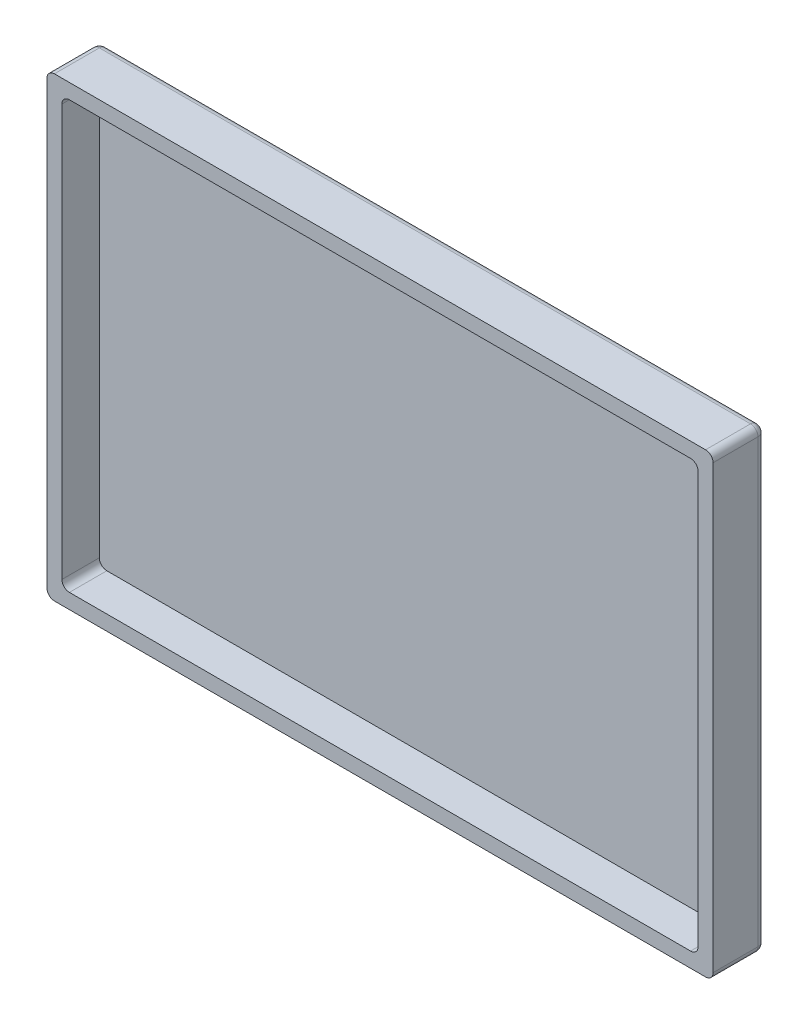
ISO-10303-21;
HEADER;
FILE_DESCRIPTION(('STEP AP214'),'2;1');
FILE_NAME('part.step','',(''),(''),'','','');
FILE_SCHEMA(('AUTOMOTIVE_DESIGN { 1 0 10303 214 1 1 1 1 }'));
ENDSEC;
DATA;
#1=APPLICATION_CONTEXT('core data for automotive mechanical design processes');
#2=APPLICATION_PROTOCOL_DEFINITION('international standard','automotive_design',2000,#1);
#3=PRODUCT_CONTEXT('',#1,'mechanical');
#4=PRODUCT('Part','Part','',(#3));
#5=PRODUCT_RELATED_PRODUCT_CATEGORY('part','',(#4));
#6=PRODUCT_DEFINITION_FORMATION('','',#4);
#7=PRODUCT_DEFINITION_CONTEXT('part definition',#1,'design');
#8=PRODUCT_DEFINITION('design','',#6,#7);
#9=PRODUCT_DEFINITION_SHAPE('','',#8);
#10=(LENGTH_UNIT() NAMED_UNIT(*) SI_UNIT(.MILLI.,.METRE.));
#11=(NAMED_UNIT(*) PLANE_ANGLE_UNIT() SI_UNIT($,.RADIAN.));
#12=(NAMED_UNIT(*) SI_UNIT($,.STERADIAN.) SOLID_ANGLE_UNIT());
#13=UNCERTAINTY_MEASURE_WITH_UNIT(LENGTH_MEASURE(1.E-05),#10,'distance_accuracy_value','');
#14=(GEOMETRIC_REPRESENTATION_CONTEXT(3) GLOBAL_UNCERTAINTY_ASSIGNED_CONTEXT((#13)) GLOBAL_UNIT_ASSIGNED_CONTEXT((#10,
#11,#12)) REPRESENTATION_CONTEXT('',''));
#15=CARTESIAN_POINT('',(0.,0.,0.));
#16=DIRECTION('',(0.,0.,1.));
#17=DIRECTION('',(1.,0.,0.));
#18=AXIS2_PLACEMENT_3D('',#15,#16,#17);
#19=CARTESIAN_POINT('',(0.,0.,5.));
#20=DIRECTION('',(0.,0.,1.));
#21=DIRECTION('',(1.,0.,0.));
#22=AXIS2_PLACEMENT_3D('',#19,#20,#21);
#23=PLANE('',#22);
#24=DIRECTION('',(1.,0.,0.));
#25=VECTOR('',#24,1.);
#26=CARTESIAN_POINT('',(-46.7633401137233,-46.7014218009479,5.));
#27=LINE('',#26,#25);
#28=CARTESIAN_POINT('',(-45.7633401137233,-46.7014218009479,5.));
#29=VERTEX_POINT('',#28);
#30=CARTESIAN_POINT('',(41.2366598862767,-46.7014218009479,5.));
#31=VERTEX_POINT('',#30);
#32=EDGE_CURVE('E367',#29,#31,#27,.T.);
#33=ORIENTED_EDGE('',*,*,#32,.T.);
#34=CARTESIAN_POINT('',(41.2366598862767,-45.7014218009479,5.));
#35=DIRECTION('',(0.,0.,1.));
#36=DIRECTION('',(1.,0.,0.));
#37=AXIS2_PLACEMENT_3D('',#34,#35,#36);
#38=CIRCLE('',#37,1.);
#39=CARTESIAN_POINT('',(42.2366598862767,-45.7014218009479,5.));
#40=VERTEX_POINT('',#39);
#41=EDGE_CURVE('E273',#31,#40,#38,.T.);
#42=ORIENTED_EDGE('',*,*,#41,.T.);
#43=DIRECTION('',(0.,1.,0.));
#44=VECTOR('',#43,1.);
#45=CARTESIAN_POINT('',(42.2366598862767,14.2985781990521,5.));
#46=LINE('',#45,#44);
#47=CARTESIAN_POINT('',(42.2366598862767,13.2985781990521,5.));
#48=VERTEX_POINT('',#47);
#49=EDGE_CURVE('E200',#40,#48,#46,.T.);
#50=ORIENTED_EDGE('',*,*,#49,.T.);
#51=CARTESIAN_POINT('',(41.2366598862767,13.2985781990521,5.));
#52=DIRECTION('',(0.,0.,1.));
#53=DIRECTION('',(1.,0.,0.));
#54=AXIS2_PLACEMENT_3D('',#51,#52,#53);
#55=CIRCLE('',#54,1.);
#56=CARTESIAN_POINT('',(41.2366598862767,14.2985781990521,5.));
#57=VERTEX_POINT('',#56);
#58=EDGE_CURVE('E270',#48,#57,#55,.T.);
#59=ORIENTED_EDGE('',*,*,#58,.T.);
#60=DIRECTION('',(-1.,0.,0.));
#61=VECTOR('',#60,1.);
#62=CARTESIAN_POINT('',(-46.7633401137233,14.2985781990521,5.));
#63=LINE('',#62,#61);
#64=CARTESIAN_POINT('',(-45.7633401137233,14.2985781990521,5.));
#65=VERTEX_POINT('',#64);
#66=EDGE_CURVE('E196',#57,#65,#63,.T.);
#67=ORIENTED_EDGE('',*,*,#66,.T.);
#68=CARTESIAN_POINT('',(-45.7633401137233,13.2985781990521,5.));
#69=DIRECTION('',(0.,0.,1.));
#70=DIRECTION('',(1.,0.,0.));
#71=AXIS2_PLACEMENT_3D('',#68,#69,#70);
#72=CIRCLE('',#71,1.);
#73=CARTESIAN_POINT('',(-46.7633401137233,13.2985781990521,5.));
#74=VERTEX_POINT('',#73);
#75=EDGE_CURVE('E267',#65,#74,#72,.T.);
#76=ORIENTED_EDGE('',*,*,#75,.T.);
#77=DIRECTION('',(0.,-1.,0.));
#78=VECTOR('',#77,1.);
#79=CARTESIAN_POINT('',(-46.7633401137233,14.2985781990521,5.));
#80=LINE('',#79,#78);
#81=CARTESIAN_POINT('',(-46.7633401137233,-45.7014218009479,5.));
#82=VERTEX_POINT('',#81);
#83=EDGE_CURVE('E363',#74,#82,#80,.T.);
#84=ORIENTED_EDGE('',*,*,#83,.T.);
#85=CARTESIAN_POINT('',(-45.7633401137233,-45.7014218009479,5.));
#86=DIRECTION('',(0.,0.,1.));
#87=DIRECTION('',(1.,0.,0.));
#88=AXIS2_PLACEMENT_3D('',#85,#86,#87);
#89=CIRCLE('',#88,1.);
#90=EDGE_CURVE('E254',#82,#29,#89,.T.);
#91=ORIENTED_EDGE('',*,*,#90,.T.);
#92=EDGE_LOOP('',(#33,#42,#50,#59,#67,#76,#84,#91));
#93=FACE_BOUND('',#92,.T.);
#94=DIRECTION('',(1.,0.,0.));
#95=VECTOR('',#94,1.);
#96=CARTESIAN_POINT('',(-44.7633401137233,-44.7014218009479,5.));
#97=LINE('',#96,#95);
#98=CARTESIAN_POINT('',(-43.7633401137233,-44.7014218009479,5.));
#99=VERTEX_POINT('',#98);
#100=CARTESIAN_POINT('',(39.2366598862767,-44.7014218009479,5.));
#101=VERTEX_POINT('',#100);
#102=EDGE_CURVE('E686',#99,#101,#97,.T.);
#103=ORIENTED_EDGE('',*,*,#102,.F.);
#104=CARTESIAN_POINT('',(-43.7633401137233,-43.7014218009479,5.));
#105=DIRECTION('',(0.,0.,1.));
#106=DIRECTION('',(1.,0.,0.));
#107=AXIS2_PLACEMENT_3D('',#104,#105,#106);
#108=CIRCLE('',#107,1.);
#109=CARTESIAN_POINT('',(-44.7633401137233,-43.7014218009478,5.));
#110=VERTEX_POINT('',#109);
#111=EDGE_CURVE('E241',#99,#110,#108,.F.);
#112=ORIENTED_EDGE('',*,*,#111,.T.);
#113=DIRECTION('',(0.,-1.,0.));
#114=VECTOR('',#113,1.);
#115=CARTESIAN_POINT('',(-44.7633401137233,12.2985781990521,5.));
#116=LINE('',#115,#114);
#117=CARTESIAN_POINT('',(-44.7633401137233,11.2985781990521,5.));
#118=VERTEX_POINT('',#117);
#119=EDGE_CURVE('E362',#118,#110,#116,.T.);
#120=ORIENTED_EDGE('',*,*,#119,.F.);
#121=CARTESIAN_POINT('',(-43.7633401137233,11.2985781990521,5.));
#122=DIRECTION('',(0.,0.,1.));
#123=DIRECTION('',(1.,0.,0.));
#124=AXIS2_PLACEMENT_3D('',#121,#122,#123);
#125=CIRCLE('',#124,1.);
#126=CARTESIAN_POINT('',(-43.7633401137233,12.2985781990521,5.));
#127=VERTEX_POINT('',#126);
#128=EDGE_CURVE('E238',#118,#127,#125,.F.);
#129=ORIENTED_EDGE('',*,*,#128,.T.);
#130=DIRECTION('',(-1.,0.,0.));
#131=VECTOR('',#130,1.);
#132=CARTESIAN_POINT('',(-44.7633401137233,12.2985781990521,5.));
#133=LINE('',#132,#131);
#134=CARTESIAN_POINT('',(39.2366598862767,12.2985781990521,5.));
#135=VERTEX_POINT('',#134);
#136=EDGE_CURVE('E357',#135,#127,#133,.T.);
#137=ORIENTED_EDGE('',*,*,#136,.F.);
#138=CARTESIAN_POINT('',(39.2366598862767,11.2985781990521,5.));
#139=DIRECTION('',(0.,0.,1.));
#140=DIRECTION('',(1.,0.,0.));
#141=AXIS2_PLACEMENT_3D('',#138,#139,#140);
#142=CIRCLE('',#141,1.);
#143=CARTESIAN_POINT('',(40.2366598862767,11.2985781990521,5.));
#144=VERTEX_POINT('',#143);
#145=EDGE_CURVE('E206',#135,#144,#142,.F.);
#146=ORIENTED_EDGE('',*,*,#145,.T.);
#147=DIRECTION('',(0.,1.,0.));
#148=VECTOR('',#147,1.);
#149=CARTESIAN_POINT('',(40.2366598862767,12.2985781990521,5.));
#150=LINE('',#149,#148);
#151=CARTESIAN_POINT('',(40.2366598862767,-43.7014218009479,5.));
#152=VERTEX_POINT('',#151);
#153=EDGE_CURVE('E193',#152,#144,#150,.T.);
#154=ORIENTED_EDGE('',*,*,#153,.F.);
#155=CARTESIAN_POINT('',(39.2366598862767,-43.7014218009479,5.));
#156=DIRECTION('',(0.,0.,1.));
#157=DIRECTION('',(1.,0.,0.));
#158=AXIS2_PLACEMENT_3D('',#155,#156,#157);
#159=CIRCLE('',#158,1.);
#160=EDGE_CURVE('E244',#152,#101,#159,.F.);
#161=ORIENTED_EDGE('',*,*,#160,.T.);
#162=EDGE_LOOP('',(#103,#112,#120,#129,#137,#146,#154,#161));
#163=FACE_BOUND('',#162,.T.);
#164=ADVANCED_FACE('F41',(#93,#163),#23,.T.);
#165=CARTESIAN_POINT('',(-46.7633401137233,14.2985781990521,5.));
#166=DIRECTION('',(1.,0.,0.));
#167=DIRECTION('',(0.,1.,0.));
#168=AXIS2_PLACEMENT_3D('',#165,#166,#167);
#169=PLANE('',#168);
#170=DIRECTION('',(0.,0.,-1.));
#171=VECTOR('',#170,1.);
#172=CARTESIAN_POINT('',(-46.7633401137233,13.2985781990521,5.));
#173=LINE('',#172,#171);
#174=CARTESIAN_POINT('',(-46.7633401137233,13.2985781990521,-1.));
#175=VERTEX_POINT('',#174);
#176=EDGE_CURVE('E283',#74,#175,#173,.T.);
#177=ORIENTED_EDGE('',*,*,#176,.T.);
#178=DIRECTION('',(0.,1.,0.));
#179=VECTOR('',#178,1.);
#180=CARTESIAN_POINT('',(-46.7633401137233,-45.7014218009479,-1.));
#181=LINE('',#180,#179);
#182=CARTESIAN_POINT('',(-46.7633401137233,-45.7014218009479,-1.));
#183=VERTEX_POINT('',#182);
#184=EDGE_CURVE('E310',#175,#183,#181,.F.);
#185=ORIENTED_EDGE('',*,*,#184,.T.);
#186=DIRECTION('',(0.,0.,-1.));
#187=VECTOR('',#186,1.);
#188=CARTESIAN_POINT('',(-46.7633401137233,-45.7014218009479,5.));
#189=LINE('',#188,#187);
#190=EDGE_CURVE('E251',#183,#82,#189,.F.);
#191=ORIENTED_EDGE('',*,*,#190,.T.);
#192=ORIENTED_EDGE('',*,*,#83,.F.);
#193=EDGE_LOOP('',(#177,#185,#191,#192));
#194=FACE_BOUND('',#193,.T.);
#195=ADVANCED_FACE('F413',(#194),#169,.F.);
#196=CARTESIAN_POINT('',(-46.7633401137233,-46.7014218009479,5.));
#197=DIRECTION('',(0.,1.,0.));
#198=DIRECTION('',(0.,0.,1.));
#199=AXIS2_PLACEMENT_3D('',#196,#197,#198);
#200=PLANE('',#199);
#201=DIRECTION('',(0.,0.,-1.));
#202=VECTOR('',#201,1.);
#203=CARTESIAN_POINT('',(-45.7633401137233,-46.7014218009479,5.));
#204=LINE('',#203,#202);
#205=CARTESIAN_POINT('',(-45.7633401137233,-46.7014218009479,-1.));
#206=VERTEX_POINT('',#205);
#207=EDGE_CURVE('E247',#29,#206,#204,.T.);
#208=ORIENTED_EDGE('',*,*,#207,.T.);
#209=DIRECTION('',(-1.,0.,0.));
#210=VECTOR('',#209,1.);
#211=CARTESIAN_POINT('',(41.2366598862767,-46.7014218009479,-1.));
#212=LINE('',#211,#210);
#213=CARTESIAN_POINT('',(41.2366598862767,-46.7014218009479,-1.));
#214=VERTEX_POINT('',#213);
#215=EDGE_CURVE('E313',#206,#214,#212,.F.);
#216=ORIENTED_EDGE('',*,*,#215,.T.);
#217=DIRECTION('',(0.,0.,-1.));
#218=VECTOR('',#217,1.);
#219=CARTESIAN_POINT('',(41.2366598862767,-46.7014218009479,5.));
#220=LINE('',#219,#218);
#221=EDGE_CURVE('E264',#214,#31,#220,.F.);
#222=ORIENTED_EDGE('',*,*,#221,.T.);
#223=ORIENTED_EDGE('',*,*,#32,.F.);
#224=EDGE_LOOP('',(#208,#216,#222,#223));
#225=FACE_BOUND('',#224,.T.);
#226=ADVANCED_FACE('F421',(#225),#200,.F.);
#227=CARTESIAN_POINT('',(42.2366598862767,14.2985781990521,5.));
#228=DIRECTION('',(-1.,0.,0.));
#229=DIRECTION('',(0.,-1.,0.));
#230=AXIS2_PLACEMENT_3D('',#227,#228,#229);
#231=PLANE('',#230);
#232=DIRECTION('',(0.,0.,-1.));
#233=VECTOR('',#232,1.);
#234=CARTESIAN_POINT('',(42.2366598862767,-45.7014218009479,5.));
#235=LINE('',#234,#233);
#236=CARTESIAN_POINT('',(42.2366598862767,-45.7014218009479,-1.));
#237=VERTEX_POINT('',#236);
#238=EDGE_CURVE('E260',#40,#237,#235,.T.);
#239=ORIENTED_EDGE('',*,*,#238,.T.);
#240=DIRECTION('',(0.,-1.,0.));
#241=VECTOR('',#240,1.);
#242=CARTESIAN_POINT('',(42.2366598862767,13.2985781990521,-1.));
#243=LINE('',#242,#241);
#244=CARTESIAN_POINT('',(42.2366598862767,13.2985781990521,-1.));
#245=VERTEX_POINT('',#244);
#246=EDGE_CURVE('E51',#237,#245,#243,.F.);
#247=ORIENTED_EDGE('',*,*,#246,.T.);
#248=DIRECTION('',(0.,0.,-1.));
#249=VECTOR('',#248,1.);
#250=CARTESIAN_POINT('',(42.2366598862767,13.2985781990521,5.));
#251=LINE('',#250,#249);
#252=EDGE_CURVE('E257',#245,#48,#251,.F.);
#253=ORIENTED_EDGE('',*,*,#252,.T.);
#254=ORIENTED_EDGE('',*,*,#49,.F.);
#255=EDGE_LOOP('',(#239,#247,#253,#254));
#256=FACE_BOUND('',#255,.T.);
#257=ADVANCED_FACE('F447',(#256),#231,.F.);
#258=CARTESIAN_POINT('',(-46.7633401137233,14.2985781990521,5.));
#259=DIRECTION('',(0.,-1.,0.));
#260=DIRECTION('',(0.,0.,-1.));
#261=AXIS2_PLACEMENT_3D('',#258,#259,#260);
#262=PLANE('',#261);
#263=DIRECTION('',(0.,0.,-1.));
#264=VECTOR('',#263,1.);
#265=CARTESIAN_POINT('',(41.2366598862767,14.2985781990521,5.));
#266=LINE('',#265,#264);
#267=CARTESIAN_POINT('',(41.2366598862767,14.2985781990521,-1.));
#268=VERTEX_POINT('',#267);
#269=EDGE_CURVE('E279',#57,#268,#266,.T.);
#270=ORIENTED_EDGE('',*,*,#269,.T.);
#271=DIRECTION('',(1.,0.,0.));
#272=VECTOR('',#271,1.);
#273=CARTESIAN_POINT('',(-45.7633401137233,14.2985781990521,-1.));
#274=LINE('',#273,#272);
#275=CARTESIAN_POINT('',(-45.7633401137233,14.2985781990521,-1.));
#276=VERTEX_POINT('',#275);
#277=EDGE_CURVE('E11',#268,#276,#274,.F.);
#278=ORIENTED_EDGE('',*,*,#277,.T.);
#279=DIRECTION('',(0.,0.,-1.));
#280=VECTOR('',#279,1.);
#281=CARTESIAN_POINT('',(-45.7633401137233,14.2985781990521,5.));
#282=LINE('',#281,#280);
#283=EDGE_CURVE('E276',#276,#65,#282,.F.);
#284=ORIENTED_EDGE('',*,*,#283,.T.);
#285=ORIENTED_EDGE('',*,*,#66,.F.);
#286=EDGE_LOOP('',(#270,#278,#284,#285));
#287=FACE_BOUND('',#286,.T.);
#288=ADVANCED_FACE('F388',(#287),#262,.F.);
#289=CARTESIAN_POINT('',(-44.7633401137233,12.2985781990521,5.));
#290=DIRECTION('',(1.,0.,0.));
#291=DIRECTION('',(0.,0.,-1.));
#292=AXIS2_PLACEMENT_3D('',#289,#290,#291);
#293=PLANE('',#292);
#294=DIRECTION('',(0.,-1.,0.));
#295=VECTOR('',#294,1.);
#296=CARTESIAN_POINT('',(-44.7633401137233,12.2985781990521,0.));
#297=LINE('',#296,#295);
#298=CARTESIAN_POINT('',(-44.7633401137233,11.2985781990521,0.));
#299=VERTEX_POINT('',#298);
#300=CARTESIAN_POINT('',(-44.7633401137233,-43.7014218009478,0.));
#301=VERTEX_POINT('',#300);
#302=EDGE_CURVE('E347',#299,#301,#297,.T.);
#303=ORIENTED_EDGE('',*,*,#302,.F.);
#304=DIRECTION('',(0.,0.,-1.));
#305=VECTOR('',#304,1.);
#306=CARTESIAN_POINT('',(-44.7633401137233,11.2985781990521,5.));
#307=LINE('',#306,#305);
#308=EDGE_CURVE('E225',#299,#118,#307,.F.);
#309=ORIENTED_EDGE('',*,*,#308,.T.);
#310=ORIENTED_EDGE('',*,*,#119,.T.);
#311=DIRECTION('',(0.,0.,-1.));
#312=VECTOR('',#311,1.);
#313=CARTESIAN_POINT('',(-44.7633401137233,-43.7014218009479,0.));
#314=LINE('',#313,#312);
#315=EDGE_CURVE('E221',#110,#301,#314,.T.);
#316=ORIENTED_EDGE('',*,*,#315,.T.);
#317=EDGE_LOOP('',(#303,#309,#310,#316));
#318=FACE_BOUND('',#317,.T.);
#319=ADVANCED_FACE('F443',(#318),#293,.T.);
#320=CARTESIAN_POINT('',(-44.7633401137233,-44.7014218009479,5.));
#321=DIRECTION('',(0.,1.,0.));
#322=DIRECTION('',(-1.,0.,0.));
#323=AXIS2_PLACEMENT_3D('',#320,#321,#322);
#324=PLANE('',#323);
#325=DIRECTION('',(1.,0.,0.));
#326=VECTOR('',#325,1.);
#327=CARTESIAN_POINT('',(-44.7633401137233,-44.7014218009479,0.));
#328=LINE('',#327,#326);
#329=CARTESIAN_POINT('',(-43.7633401137233,-44.7014218009479,0.));
#330=VERTEX_POINT('',#329);
#331=CARTESIAN_POINT('',(39.2366598862767,-44.7014218009479,0.));
#332=VERTEX_POINT('',#331);
#333=EDGE_CURVE('E180',#330,#332,#328,.T.);
#334=ORIENTED_EDGE('',*,*,#333,.F.);
#335=DIRECTION('',(0.,0.,-1.));
#336=VECTOR('',#335,1.);
#337=CARTESIAN_POINT('',(-43.7633401137233,-44.7014218009479,5.));
#338=LINE('',#337,#336);
#339=EDGE_CURVE('E232',#330,#99,#338,.F.);
#340=ORIENTED_EDGE('',*,*,#339,.T.);
#341=ORIENTED_EDGE('',*,*,#102,.T.);
#342=DIRECTION('',(0.,0.,-1.));
#343=VECTOR('',#342,1.);
#344=CARTESIAN_POINT('',(39.2366598862767,-44.7014218009479,0.));
#345=LINE('',#344,#343);
#346=EDGE_CURVE('E228',#101,#332,#345,.T.);
#347=ORIENTED_EDGE('',*,*,#346,.T.);
#348=EDGE_LOOP('',(#334,#340,#341,#347));
#349=FACE_BOUND('',#348,.T.);
#350=ADVANCED_FACE('F640',(#349),#324,.T.);
#351=CARTESIAN_POINT('',(40.2366598862767,12.2985781990521,5.));
#352=DIRECTION('',(-1.,0.,0.));
#353=DIRECTION('',(0.,-1.,0.));
#354=AXIS2_PLACEMENT_3D('',#351,#352,#353);
#355=PLANE('',#354);
#356=DIRECTION('',(0.,1.,0.));
#357=VECTOR('',#356,1.);
#358=CARTESIAN_POINT('',(40.2366598862767,12.2985781990521,0.));
#359=LINE('',#358,#357);
#360=CARTESIAN_POINT('',(40.2366598862767,-43.7014218009479,0.));
#361=VERTEX_POINT('',#360);
#362=CARTESIAN_POINT('',(40.2366598862767,11.2985781990521,0.));
#363=VERTEX_POINT('',#362);
#364=EDGE_CURVE('E167',#361,#363,#359,.T.);
#365=ORIENTED_EDGE('',*,*,#364,.F.);
#366=DIRECTION('',(0.,0.,-1.));
#367=VECTOR('',#366,1.);
#368=CARTESIAN_POINT('',(40.2366598862767,-43.7014218009479,5.));
#369=LINE('',#368,#367);
#370=EDGE_CURVE('E235',#361,#152,#369,.F.);
#371=ORIENTED_EDGE('',*,*,#370,.T.);
#372=ORIENTED_EDGE('',*,*,#153,.T.);
#373=DIRECTION('',(0.,0.,-1.));
#374=VECTOR('',#373,1.);
#375=CARTESIAN_POINT('',(40.2366598862767,11.2985781990521,0.));
#376=LINE('',#375,#374);
#377=EDGE_CURVE('E187',#144,#363,#376,.T.);
#378=ORIENTED_EDGE('',*,*,#377,.T.);
#379=EDGE_LOOP('',(#365,#371,#372,#378));
#380=FACE_BOUND('',#379,.T.);
#381=ADVANCED_FACE('F191',(#380),#355,.T.);
#382=CARTESIAN_POINT('',(-44.7633401137233,12.2985781990521,5.));
#383=DIRECTION('',(0.,-1.,0.));
#384=DIRECTION('',(0.,0.,-1.));
#385=AXIS2_PLACEMENT_3D('',#382,#383,#384);
#386=PLANE('',#385);
#387=ORIENTED_EDGE('',*,*,#136,.T.);
#388=DIRECTION('',(0.,0.,-1.));
#389=VECTOR('',#388,1.);
#390=CARTESIAN_POINT('',(-43.7633401137233,12.2985781990521,0.));
#391=LINE('',#390,#389);
#392=CARTESIAN_POINT('',(-43.7633401137233,12.2985781990521,0.));
#393=VERTEX_POINT('',#392);
#394=EDGE_CURVE('E209',#127,#393,#391,.T.);
#395=ORIENTED_EDGE('',*,*,#394,.T.);
#396=DIRECTION('',(-1.,0.,0.));
#397=VECTOR('',#396,1.);
#398=CARTESIAN_POINT('',(-44.7633401137233,12.2985781990521,0.));
#399=LINE('',#398,#397);
#400=CARTESIAN_POINT('',(39.2366598862767,12.2985781990521,0.));
#401=VERTEX_POINT('',#400);
#402=EDGE_CURVE('E179',#401,#393,#399,.T.);
#403=ORIENTED_EDGE('',*,*,#402,.F.);
#404=DIRECTION('',(0.,0.,-1.));
#405=VECTOR('',#404,1.);
#406=CARTESIAN_POINT('',(39.2366598862767,12.2985781990521,5.));
#407=LINE('',#406,#405);
#408=EDGE_CURVE('E188',#401,#135,#407,.F.);
#409=ORIENTED_EDGE('',*,*,#408,.T.);
#410=EDGE_LOOP('',(#387,#395,#403,#409));
#411=FACE_BOUND('',#410,.T.);
#412=ADVANCED_FACE('F591',(#411),#386,.T.);
#413=CARTESIAN_POINT('',(0.,0.,0.));
#414=DIRECTION('',(0.,0.,-1.));
#415=DIRECTION('',(-1.,0.,0.));
#416=AXIS2_PLACEMENT_3D('',#413,#414,#415);
#417=PLANE('',#416);
#418=ORIENTED_EDGE('',*,*,#402,.T.);
#419=CARTESIAN_POINT('',(-43.7633401137233,11.2985781990521,0.));
#420=DIRECTION('',(0.,0.,-1.));
#421=DIRECTION('',(-1.,0.,0.));
#422=AXIS2_PLACEMENT_3D('',#419,#420,#421);
#423=CIRCLE('',#422,1.);
#424=EDGE_CURVE('E218',#393,#299,#423,.F.);
#425=ORIENTED_EDGE('',*,*,#424,.T.);
#426=ORIENTED_EDGE('',*,*,#302,.T.);
#427=CARTESIAN_POINT('',(-43.7633401137233,-43.7014218009479,0.));
#428=DIRECTION('',(0.,0.,-1.));
#429=DIRECTION('',(-1.,0.,0.));
#430=AXIS2_PLACEMENT_3D('',#427,#428,#429);
#431=CIRCLE('',#430,1.);
#432=EDGE_CURVE('E215',#301,#330,#431,.F.);
#433=ORIENTED_EDGE('',*,*,#432,.T.);
#434=ORIENTED_EDGE('',*,*,#333,.T.);
#435=CARTESIAN_POINT('',(39.2366598862767,-43.7014218009479,0.));
#436=DIRECTION('',(0.,0.,-1.));
#437=DIRECTION('',(-1.,0.,0.));
#438=AXIS2_PLACEMENT_3D('',#435,#436,#437);
#439=CIRCLE('',#438,1.);
#440=EDGE_CURVE('E174',#332,#361,#439,.F.);
#441=ORIENTED_EDGE('',*,*,#440,.T.);
#442=ORIENTED_EDGE('',*,*,#364,.T.);
#443=CARTESIAN_POINT('',(39.2366598862767,11.2985781990521,0.));
#444=DIRECTION('',(0.,0.,-1.));
#445=DIRECTION('',(-1.,0.,0.));
#446=AXIS2_PLACEMENT_3D('',#443,#444,#445);
#447=CIRCLE('',#446,1.);
#448=EDGE_CURVE('E171',#363,#401,#447,.F.);
#449=ORIENTED_EDGE('',*,*,#448,.T.);
#450=EDGE_LOOP('',(#418,#425,#426,#433,#434,#441,#442,#449));
#451=FACE_BOUND('',#450,.T.);
#452=ADVANCED_FACE('F170',(#451),#417,.F.);
#453=CARTESIAN_POINT('',(0.,0.,-2.));
#454=DIRECTION('',(0.,0.,-1.));
#455=DIRECTION('',(-1.,0.,0.));
#456=AXIS2_PLACEMENT_3D('',#453,#454,#455);
#457=PLANE('',#456);
#458=DIRECTION('',(-1.,0.,0.));
#459=VECTOR('',#458,1.);
#460=CARTESIAN_POINT('',(-45.7633401137233,-45.7014218009479,-2.));
#461=LINE('',#460,#459);
#462=CARTESIAN_POINT('',(41.2366598862767,-45.7014218009479,-2.));
#463=VERTEX_POINT('',#462);
#464=CARTESIAN_POINT('',(-45.7633401137233,-45.7014218009479,-2.));
#465=VERTEX_POINT('',#464);
#466=EDGE_CURVE('E59',#463,#465,#461,.T.);
#467=ORIENTED_EDGE('',*,*,#466,.T.);
#468=DIRECTION('',(0.,1.,0.));
#469=VECTOR('',#468,1.);
#470=CARTESIAN_POINT('',(-45.7633401137233,13.2985781990521,-2.));
#471=LINE('',#470,#469);
#472=CARTESIAN_POINT('',(-45.7633401137233,13.2985781990521,-2.));
#473=VERTEX_POINT('',#472);
#474=EDGE_CURVE('E307',#465,#473,#471,.T.);
#475=ORIENTED_EDGE('',*,*,#474,.T.);
#476=DIRECTION('',(1.,0.,0.));
#477=VECTOR('',#476,1.);
#478=CARTESIAN_POINT('',(41.2366598862767,13.2985781990521,-2.));
#479=LINE('',#478,#477);
#480=CARTESIAN_POINT('',(41.2366598862767,13.2985781990521,-2.));
#481=VERTEX_POINT('',#480);
#482=EDGE_CURVE('E300',#473,#481,#479,.T.);
#483=ORIENTED_EDGE('',*,*,#482,.T.);
#484=DIRECTION('',(0.,-1.,0.));
#485=VECTOR('',#484,1.);
#486=CARTESIAN_POINT('',(41.2366598862767,-45.7014218009479,-2.));
#487=LINE('',#486,#485);
#488=EDGE_CURVE('E64',#481,#463,#487,.T.);
#489=ORIENTED_EDGE('',*,*,#488,.T.);
#490=EDGE_LOOP('',(#467,#475,#483,#489));
#491=FACE_BOUND('',#490,.T.);
#492=ADVANCED_FACE('F455',(#491),#457,.T.);
#493=CARTESIAN_POINT('',(39.2366598862767,11.2985781990521,5.));
#494=DIRECTION('',(0.,0.,1.));
#495=DIRECTION('',(1.,0.,0.));
#496=AXIS2_PLACEMENT_3D('',#493,#494,#495);
#497=CYLINDRICAL_SURFACE('',#496,1.);
#498=ORIENTED_EDGE('',*,*,#145,.F.);
#499=ORIENTED_EDGE('',*,*,#408,.F.);
#500=ORIENTED_EDGE('',*,*,#448,.F.);
#501=ORIENTED_EDGE('',*,*,#377,.F.);
#502=EDGE_LOOP('',(#498,#499,#500,#501));
#503=FACE_BOUND('',#502,.T.);
#504=ADVANCED_FACE('F186',(#503),#497,.F.);
#505=CARTESIAN_POINT('',(-43.7633401137233,11.2985781990521,5.));
#506=DIRECTION('',(0.,0.,1.));
#507=DIRECTION('',(1.,0.,0.));
#508=AXIS2_PLACEMENT_3D('',#505,#506,#507);
#509=CYLINDRICAL_SURFACE('',#508,1.);
#510=ORIENTED_EDGE('',*,*,#128,.F.);
#511=ORIENTED_EDGE('',*,*,#308,.F.);
#512=ORIENTED_EDGE('',*,*,#424,.F.);
#513=ORIENTED_EDGE('',*,*,#394,.F.);
#514=EDGE_LOOP('',(#510,#511,#512,#513));
#515=FACE_BOUND('',#514,.T.);
#516=ADVANCED_FACE('F454',(#515),#509,.F.);
#517=CARTESIAN_POINT('',(-43.7633401137233,-43.7014218009479,5.));
#518=DIRECTION('',(0.,0.,1.));
#519=DIRECTION('',(1.,0.,0.));
#520=AXIS2_PLACEMENT_3D('',#517,#518,#519);
#521=CYLINDRICAL_SURFACE('',#520,1.);
#522=ORIENTED_EDGE('',*,*,#111,.F.);
#523=ORIENTED_EDGE('',*,*,#339,.F.);
#524=ORIENTED_EDGE('',*,*,#432,.F.);
#525=ORIENTED_EDGE('',*,*,#315,.F.);
#526=EDGE_LOOP('',(#522,#523,#524,#525));
#527=FACE_BOUND('',#526,.T.);
#528=ADVANCED_FACE('F458',(#527),#521,.F.);
#529=CARTESIAN_POINT('',(39.2366598862767,-43.7014218009479,5.));
#530=DIRECTION('',(0.,0.,1.));
#531=DIRECTION('',(1.,0.,0.));
#532=AXIS2_PLACEMENT_3D('',#529,#530,#531);
#533=CYLINDRICAL_SURFACE('',#532,1.);
#534=ORIENTED_EDGE('',*,*,#160,.F.);
#535=ORIENTED_EDGE('',*,*,#370,.F.);
#536=ORIENTED_EDGE('',*,*,#440,.F.);
#537=ORIENTED_EDGE('',*,*,#346,.F.);
#538=EDGE_LOOP('',(#534,#535,#536,#537));
#539=FACE_BOUND('',#538,.T.);
#540=ADVANCED_FACE('F462',(#539),#533,.F.);
#541=CARTESIAN_POINT('',(-45.7633401137233,-45.7014218009479,5.));
#542=DIRECTION('',(0.,0.,-1.));
#543=DIRECTION('',(-1.,0.,0.));
#544=AXIS2_PLACEMENT_3D('',#541,#542,#543);
#545=CYLINDRICAL_SURFACE('',#544,1.);
#546=ORIENTED_EDGE('',*,*,#190,.F.);
#547=CARTESIAN_POINT('',(-45.7633401137233,-45.7014218009479,-1.));
#548=DIRECTION('',(0.,0.,-1.));
#549=DIRECTION('',(-1.,0.,0.));
#550=AXIS2_PLACEMENT_3D('',#547,#548,#549);
#551=CIRCLE('',#550,1.);
#552=EDGE_CURVE('E291',#183,#206,#551,.F.);
#553=ORIENTED_EDGE('',*,*,#552,.T.);
#554=ORIENTED_EDGE('',*,*,#207,.F.);
#555=ORIENTED_EDGE('',*,*,#90,.F.);
#556=EDGE_LOOP('',(#546,#553,#554,#555));
#557=FACE_BOUND('',#556,.T.);
#558=ADVANCED_FACE('F418',(#557),#545,.T.);
#559=CARTESIAN_POINT('',(41.2366598862767,-45.7014218009479,5.));
#560=DIRECTION('',(0.,0.,-1.));
#561=DIRECTION('',(-1.,0.,0.));
#562=AXIS2_PLACEMENT_3D('',#559,#560,#561);
#563=CYLINDRICAL_SURFACE('',#562,1.);
#564=ORIENTED_EDGE('',*,*,#221,.F.);
#565=CARTESIAN_POINT('',(41.2366598862767,-45.7014218009479,-1.));
#566=DIRECTION('',(0.,0.,-1.));
#567=DIRECTION('',(-1.,0.,0.));
#568=AXIS2_PLACEMENT_3D('',#565,#566,#567);
#569=CIRCLE('',#568,1.);
#570=EDGE_CURVE('E294',#214,#237,#569,.F.);
#571=ORIENTED_EDGE('',*,*,#570,.T.);
#572=ORIENTED_EDGE('',*,*,#238,.F.);
#573=ORIENTED_EDGE('',*,*,#41,.F.);
#574=EDGE_LOOP('',(#564,#571,#572,#573));
#575=FACE_BOUND('',#574,.T.);
#576=ADVANCED_FACE('F469',(#575),#563,.T.);
#577=CARTESIAN_POINT('',(41.2366598862767,13.2985781990521,5.));
#578=DIRECTION('',(0.,0.,-1.));
#579=DIRECTION('',(-1.,0.,0.));
#580=AXIS2_PLACEMENT_3D('',#577,#578,#579);
#581=CYLINDRICAL_SURFACE('',#580,1.);
#582=ORIENTED_EDGE('',*,*,#252,.F.);
#583=CARTESIAN_POINT('',(41.2366598862767,13.2985781990521,-1.));
#584=DIRECTION('',(0.,0.,-1.));
#585=DIRECTION('',(-1.,0.,0.));
#586=AXIS2_PLACEMENT_3D('',#583,#584,#585);
#587=CIRCLE('',#586,1.);
#588=EDGE_CURVE('E297',#245,#268,#587,.F.);
#589=ORIENTED_EDGE('',*,*,#588,.T.);
#590=ORIENTED_EDGE('',*,*,#269,.F.);
#591=ORIENTED_EDGE('',*,*,#58,.F.);
#592=EDGE_LOOP('',(#582,#589,#590,#591));
#593=FACE_BOUND('',#592,.T.);
#594=ADVANCED_FACE('F383',(#593),#581,.T.);
#595=CARTESIAN_POINT('',(-45.7633401137233,13.2985781990521,5.));
#596=DIRECTION('',(0.,0.,-1.));
#597=DIRECTION('',(-1.,0.,0.));
#598=AXIS2_PLACEMENT_3D('',#595,#596,#597);
#599=CYLINDRICAL_SURFACE('',#598,1.);
#600=ORIENTED_EDGE('',*,*,#283,.F.);
#601=CARTESIAN_POINT('',(-45.7633401137233,13.2985781990521,-1.));
#602=DIRECTION('',(0.,0.,-1.));
#603=DIRECTION('',(-1.,0.,0.));
#604=AXIS2_PLACEMENT_3D('',#601,#602,#603);
#605=CIRCLE('',#604,1.);
#606=EDGE_CURVE('E287',#276,#175,#605,.F.);
#607=ORIENTED_EDGE('',*,*,#606,.T.);
#608=ORIENTED_EDGE('',*,*,#176,.F.);
#609=ORIENTED_EDGE('',*,*,#75,.F.);
#610=EDGE_LOOP('',(#600,#607,#608,#609));
#611=FACE_BOUND('',#610,.T.);
#612=ADVANCED_FACE('F410',(#611),#599,.T.);
#613=CARTESIAN_POINT('',(41.2366598862767,-45.7014218009479,-1.));
#614=DIRECTION('',(0.,0.,-1.));
#615=DIRECTION('',(-1.,0.,0.));
#616=AXIS2_PLACEMENT_3D('',#613,#614,#615);
#617=SPHERICAL_SURFACE('',#616,1.);
#618=CARTESIAN_POINT('',(41.2366598862767,-45.7014218009479,-1.));
#619=DIRECTION('',(0.,1.,0.));
#620=DIRECTION('',(0.,0.,1.));
#621=AXIS2_PLACEMENT_3D('',#618,#619,#620);
#622=CIRCLE('',#621,1.);
#623=EDGE_CURVE('E339',#237,#463,#622,.T.);
#624=ORIENTED_EDGE('',*,*,#623,.F.);
#625=ORIENTED_EDGE('',*,*,#570,.F.);
#626=CARTESIAN_POINT('',(41.2366598862767,-45.7014218009479,-1.));
#627=DIRECTION('',(-1.,0.,0.));
#628=DIRECTION('',(0.,0.,1.));
#629=AXIS2_PLACEMENT_3D('',#626,#627,#628);
#630=CIRCLE('',#629,1.);
#631=EDGE_CURVE('E45',#463,#214,#630,.T.);
#632=ORIENTED_EDGE('',*,*,#631,.F.);
#633=EDGE_LOOP('',(#624,#625,#632));
#634=FACE_BOUND('',#633,.T.);
#635=ADVANCED_FACE('F43',(#634),#617,.T.);
#636=CARTESIAN_POINT('',(0.,-45.7014218009479,-1.));
#637=DIRECTION('',(1.,0.,0.));
#638=DIRECTION('',(0.,0.,-1.));
#639=AXIS2_PLACEMENT_3D('',#636,#637,#638);
#640=CYLINDRICAL_SURFACE('',#639,1.);
#641=ORIENTED_EDGE('',*,*,#631,.T.);
#642=ORIENTED_EDGE('',*,*,#215,.F.);
#643=CARTESIAN_POINT('',(-45.7633401137233,-45.7014218009479,-1.));
#644=DIRECTION('',(-1.,0.,0.));
#645=DIRECTION('',(0.,0.,1.));
#646=AXIS2_PLACEMENT_3D('',#643,#644,#645);
#647=CIRCLE('',#646,1.);
#648=EDGE_CURVE('E336',#465,#206,#647,.T.);
#649=ORIENTED_EDGE('',*,*,#648,.F.);
#650=ORIENTED_EDGE('',*,*,#466,.F.);
#651=EDGE_LOOP('',(#641,#642,#649,#650));
#652=FACE_BOUND('',#651,.T.);
#653=ADVANCED_FACE('F423',(#652),#640,.T.);
#654=CARTESIAN_POINT('',(41.2366598862767,0.,-1.));
#655=DIRECTION('',(0.,1.,0.));
#656=DIRECTION('',(-1.,0.,0.));
#657=AXIS2_PLACEMENT_3D('',#654,#655,#656);
#658=CYLINDRICAL_SURFACE('',#657,1.);
#659=ORIENTED_EDGE('',*,*,#623,.T.);
#660=ORIENTED_EDGE('',*,*,#488,.F.);
#661=CARTESIAN_POINT('',(41.2366598862767,13.2985781990521,-1.));
#662=DIRECTION('',(0.,1.,0.));
#663=DIRECTION('',(0.,0.,1.));
#664=AXIS2_PLACEMENT_3D('',#661,#662,#663);
#665=CIRCLE('',#664,1.);
#666=EDGE_CURVE('E332',#245,#481,#665,.T.);
#667=ORIENTED_EDGE('',*,*,#666,.F.);
#668=ORIENTED_EDGE('',*,*,#246,.F.);
#669=EDGE_LOOP('',(#659,#660,#667,#668));
#670=FACE_BOUND('',#669,.T.);
#671=ADVANCED_FACE('F427',(#670),#658,.T.);
#672=CARTESIAN_POINT('',(-45.7633401137233,-45.7014218009479,-1.));
#673=DIRECTION('',(0.,0.,-1.));
#674=DIRECTION('',(-1.,0.,0.));
#675=AXIS2_PLACEMENT_3D('',#672,#673,#674);
#676=SPHERICAL_SURFACE('',#675,1.);
#677=ORIENTED_EDGE('',*,*,#648,.T.);
#678=ORIENTED_EDGE('',*,*,#552,.F.);
#679=CARTESIAN_POINT('',(-45.7633401137233,-45.7014218009479,-1.));
#680=DIRECTION('',(0.,1.,0.));
#681=DIRECTION('',(0.,0.,1.));
#682=AXIS2_PLACEMENT_3D('',#679,#680,#681);
#683=CIRCLE('',#682,1.);
#684=EDGE_CURVE('E328',#465,#183,#683,.T.);
#685=ORIENTED_EDGE('',*,*,#684,.F.);
#686=EDGE_LOOP('',(#677,#678,#685));
#687=FACE_BOUND('',#686,.T.);
#688=ADVANCED_FACE('F425',(#687),#676,.T.);
#689=CARTESIAN_POINT('',(41.2366598862767,13.2985781990521,-1.));
#690=DIRECTION('',(0.,0.,-1.));
#691=DIRECTION('',(-1.,0.,0.));
#692=AXIS2_PLACEMENT_3D('',#689,#690,#691);
#693=SPHERICAL_SURFACE('',#692,1.);
#694=ORIENTED_EDGE('',*,*,#588,.F.);
#695=ORIENTED_EDGE('',*,*,#666,.T.);
#696=CARTESIAN_POINT('',(41.2366598862767,13.2985781990521,-1.));
#697=DIRECTION('',(-1.,0.,0.));
#698=DIRECTION('',(0.,0.,1.));
#699=AXIS2_PLACEMENT_3D('',#696,#697,#698);
#700=CIRCLE('',#699,1.);
#701=EDGE_CURVE('E324',#268,#481,#700,.T.);
#702=ORIENTED_EDGE('',*,*,#701,.F.);
#703=EDGE_LOOP('',(#694,#695,#702));
#704=FACE_BOUND('',#703,.T.);
#705=ADVANCED_FACE('F392',(#704),#693,.T.);
#706=CARTESIAN_POINT('',(-45.7633401137233,0.,-1.));
#707=DIRECTION('',(0.,-1.,0.));
#708=DIRECTION('',(1.,0.,0.));
#709=AXIS2_PLACEMENT_3D('',#706,#707,#708);
#710=CYLINDRICAL_SURFACE('',#709,1.);
#711=ORIENTED_EDGE('',*,*,#684,.T.);
#712=ORIENTED_EDGE('',*,*,#184,.F.);
#713=CARTESIAN_POINT('',(-45.7633401137233,13.2985781990521,-1.));
#714=DIRECTION('',(0.,1.,0.));
#715=DIRECTION('',(0.,0.,1.));
#716=AXIS2_PLACEMENT_3D('',#713,#714,#715);
#717=CIRCLE('',#716,1.);
#718=EDGE_CURVE('E321',#473,#175,#717,.T.);
#719=ORIENTED_EDGE('',*,*,#718,.F.);
#720=ORIENTED_EDGE('',*,*,#474,.F.);
#721=EDGE_LOOP('',(#711,#712,#719,#720));
#722=FACE_BOUND('',#721,.T.);
#723=ADVANCED_FACE('F404',(#722),#710,.T.);
#724=CARTESIAN_POINT('',(0.,13.2985781990521,-1.));
#725=DIRECTION('',(-1.,0.,0.));
#726=DIRECTION('',(0.,0.,1.));
#727=AXIS2_PLACEMENT_3D('',#724,#725,#726);
#728=CYLINDRICAL_SURFACE('',#727,1.);
#729=ORIENTED_EDGE('',*,*,#701,.T.);
#730=ORIENTED_EDGE('',*,*,#482,.F.);
#731=CARTESIAN_POINT('',(-45.7633401137233,13.2985781990521,-1.));
#732=DIRECTION('',(-1.,0.,0.));
#733=DIRECTION('',(0.,0.,1.));
#734=AXIS2_PLACEMENT_3D('',#731,#732,#733);
#735=CIRCLE('',#734,1.);
#736=EDGE_CURVE('E318',#276,#473,#735,.T.);
#737=ORIENTED_EDGE('',*,*,#736,.F.);
#738=ORIENTED_EDGE('',*,*,#277,.F.);
#739=EDGE_LOOP('',(#729,#730,#737,#738));
#740=FACE_BOUND('',#739,.T.);
#741=ADVANCED_FACE('F396',(#740),#728,.T.);
#742=CARTESIAN_POINT('',(-45.7633401137233,13.2985781990521,-1.));
#743=DIRECTION('',(0.,0.,-1.));
#744=DIRECTION('',(-1.,0.,0.));
#745=AXIS2_PLACEMENT_3D('',#742,#743,#744);
#746=SPHERICAL_SURFACE('',#745,1.);
#747=ORIENTED_EDGE('',*,*,#718,.T.);
#748=ORIENTED_EDGE('',*,*,#606,.F.);
#749=ORIENTED_EDGE('',*,*,#736,.T.);
#750=EDGE_LOOP('',(#747,#748,#749));
#751=FACE_BOUND('',#750,.T.);
#752=ADVANCED_FACE('F400',(#751),#746,.T.);
#753=CLOSED_SHELL('',(#164,#195,#226,#257,#288,#319,#350,#381,#412,#452,#492,#504,#516,#528,
#540,#558,#576,#594,#612,#635,#653,#671,#688,#705,#723,#741,#752));
#754=MANIFOLD_SOLID_BREP('B2',#753);
#755=ADVANCED_BREP_SHAPE_REPRESENTATION('',(#18,#754),#14);
#756=SHAPE_DEFINITION_REPRESENTATION(#9,#755);
ENDSEC;
END-ISO-10303-21;
